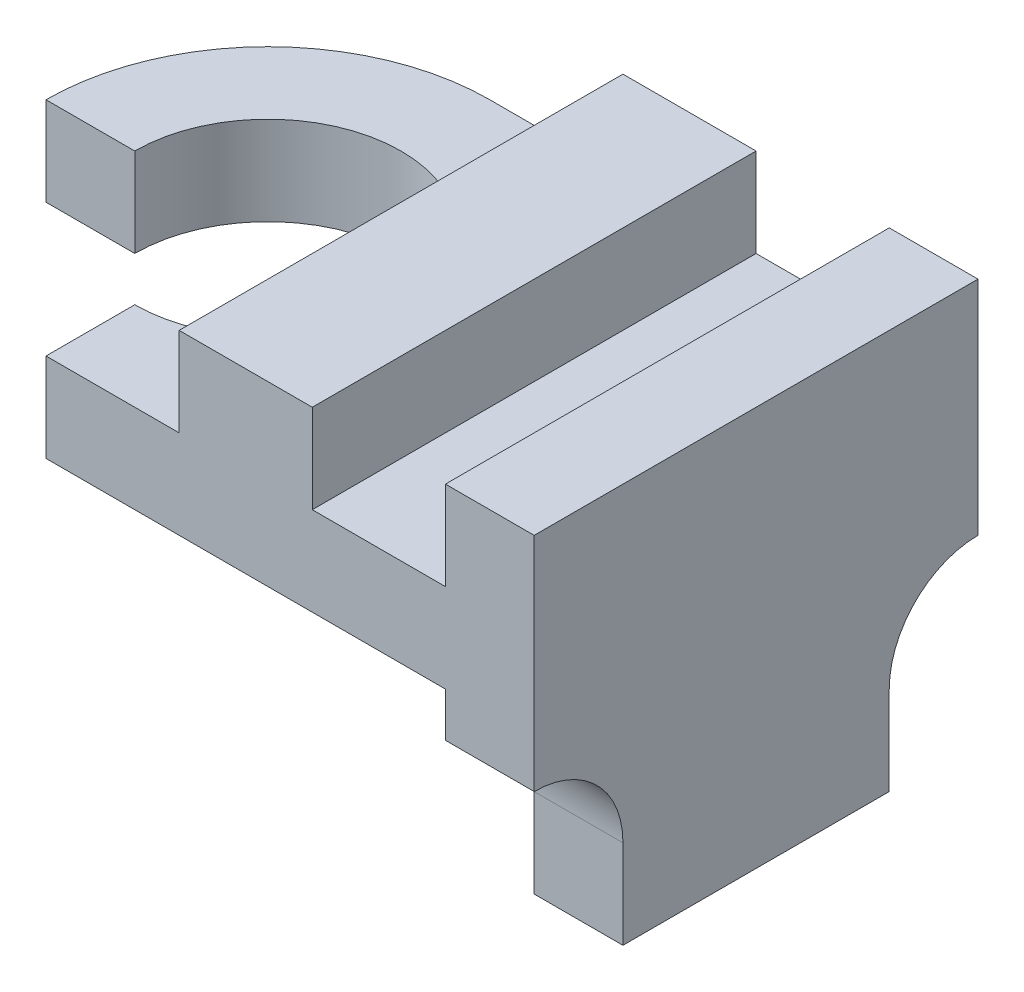
ISO-10303-21;
HEADER;
FILE_DESCRIPTION(('STEP AP214'),'2;1');
FILE_NAME('part.step','',(''),(''),'','','');
FILE_SCHEMA(('AUTOMOTIVE_DESIGN { 1 0 10303 214 1 1 1 1 }'));
ENDSEC;
DATA;
#1=APPLICATION_CONTEXT('core data for automotive mechanical design processes');
#2=APPLICATION_PROTOCOL_DEFINITION('international standard','automotive_design',2000,#1);
#3=PRODUCT_CONTEXT('',#1,'mechanical');
#4=PRODUCT('Part','Part','',(#3));
#5=PRODUCT_RELATED_PRODUCT_CATEGORY('part','',(#4));
#6=PRODUCT_DEFINITION_FORMATION('','',#4);
#7=PRODUCT_DEFINITION_CONTEXT('part definition',#1,'design');
#8=PRODUCT_DEFINITION('design','',#6,#7);
#9=PRODUCT_DEFINITION_SHAPE('','',#8);
#10=(LENGTH_UNIT() NAMED_UNIT(*) SI_UNIT(.MILLI.,.METRE.));
#11=(NAMED_UNIT(*) PLANE_ANGLE_UNIT() SI_UNIT($,.RADIAN.));
#12=(NAMED_UNIT(*) SI_UNIT($,.STERADIAN.) SOLID_ANGLE_UNIT());
#13=UNCERTAINTY_MEASURE_WITH_UNIT(LENGTH_MEASURE(1.E-05),#10,'distance_accuracy_value','');
#14=(GEOMETRIC_REPRESENTATION_CONTEXT(3) GLOBAL_UNCERTAINTY_ASSIGNED_CONTEXT((#13)) GLOBAL_UNIT_ASSIGNED_CONTEXT((#10,
#11,#12)) REPRESENTATION_CONTEXT('',''));
#15=CARTESIAN_POINT('',(0.,0.,0.));
#16=DIRECTION('',(0.,0.,1.));
#17=DIRECTION('',(1.,0.,0.));
#18=AXIS2_PLACEMENT_3D('',#15,#16,#17);
#19=CARTESIAN_POINT('',(0.,0.,0.));
#20=DIRECTION('',(0.,0.,-1.));
#21=DIRECTION('',(-1.,0.,0.));
#22=AXIS2_PLACEMENT_3D('',#19,#20,#21);
#23=PLANE('',#22);
#24=DIRECTION('',(1.,0.,0.));
#25=VECTOR('',#24,1.);
#26=CARTESIAN_POINT('',(0.,0.,0.));
#27=LINE('',#26,#25);
#28=CARTESIAN_POINT('',(0.,0.,0.));
#29=VERTEX_POINT('',#28);
#30=CARTESIAN_POINT('',(90.,0.,0.));
#31=VERTEX_POINT('',#30);
#32=EDGE_CURVE('E37',#29,#31,#27,.T.);
#33=ORIENTED_EDGE('',*,*,#32,.F.);
#34=DIRECTION('',(0.,-1.,0.));
#35=VECTOR('',#34,1.);
#36=CARTESIAN_POINT('',(0.,20.,0.));
#37=LINE('',#36,#35);
#38=CARTESIAN_POINT('',(0.,20.,0.));
#39=VERTEX_POINT('',#38);
#40=EDGE_CURVE('E207',#39,#29,#37,.T.);
#41=ORIENTED_EDGE('',*,*,#40,.F.);
#42=DIRECTION('',(1.,0.,0.));
#43=VECTOR('',#42,1.);
#44=CARTESIAN_POINT('',(0.,20.,0.));
#45=LINE('',#44,#43);
#46=CARTESIAN_POINT('',(30.,20.,0.));
#47=VERTEX_POINT('',#46);
#48=EDGE_CURVE('E206',#39,#47,#45,.T.);
#49=ORIENTED_EDGE('',*,*,#48,.T.);
#50=DIRECTION('',(0.,1.,0.));
#51=VECTOR('',#50,1.);
#52=CARTESIAN_POINT('',(30.,40.,0.));
#53=LINE('',#52,#51);
#54=CARTESIAN_POINT('',(30.,40.,0.));
#55=VERTEX_POINT('',#54);
#56=EDGE_CURVE('E277',#47,#55,#53,.T.);
#57=ORIENTED_EDGE('',*,*,#56,.T.);
#58=DIRECTION('',(-1.,0.,0.));
#59=VECTOR('',#58,1.);
#60=CARTESIAN_POINT('',(0.,40.,0.));
#61=LINE('',#60,#59);
#62=CARTESIAN_POINT('',(60.,40.,0.));
#63=VERTEX_POINT('',#62);
#64=EDGE_CURVE('E253',#63,#55,#61,.T.);
#65=ORIENTED_EDGE('',*,*,#64,.F.);
#66=DIRECTION('',(0.,-1.,0.));
#67=VECTOR('',#66,1.);
#68=CARTESIAN_POINT('',(60.,40.,0.));
#69=LINE('',#68,#67);
#70=CARTESIAN_POINT('',(60.,20.,0.));
#71=VERTEX_POINT('',#70);
#72=EDGE_CURVE('E275',#63,#71,#69,.T.);
#73=ORIENTED_EDGE('',*,*,#72,.T.);
#74=DIRECTION('',(1.,0.,0.));
#75=VECTOR('',#74,1.);
#76=CARTESIAN_POINT('',(90.,20.,0.));
#77=LINE('',#76,#75);
#78=CARTESIAN_POINT('',(90.,20.,0.));
#79=VERTEX_POINT('',#78);
#80=EDGE_CURVE('E300',#71,#79,#77,.T.);
#81=ORIENTED_EDGE('',*,*,#80,.T.);
#82=DIRECTION('',(0.,1.,0.));
#83=VECTOR('',#82,1.);
#84=CARTESIAN_POINT('',(90.,40.,0.));
#85=LINE('',#84,#83);
#86=CARTESIAN_POINT('',(90.,40.,0.));
#87=VERTEX_POINT('',#86);
#88=EDGE_CURVE('E295',#79,#87,#85,.T.);
#89=ORIENTED_EDGE('',*,*,#88,.T.);
#90=CARTESIAN_POINT('',(110.,40.,0.));
#91=VERTEX_POINT('',#90);
#92=EDGE_CURVE('E254',#91,#87,#61,.T.);
#93=ORIENTED_EDGE('',*,*,#92,.F.);
#94=DIRECTION('',(0.,1.,0.));
#95=VECTOR('',#94,1.);
#96=CARTESIAN_POINT('',(110.,0.,0.));
#97=LINE('',#96,#95);
#98=CARTESIAN_POINT('',(110.,-10.,0.));
#99=VERTEX_POINT('',#98);
#100=EDGE_CURVE('E252',#99,#91,#97,.T.);
#101=ORIENTED_EDGE('',*,*,#100,.F.);
#102=DIRECTION('',(-1.,0.,0.));
#103=VECTOR('',#102,1.);
#104=CARTESIAN_POINT('',(140.,-10.,0.));
#105=LINE('',#104,#103);
#106=CARTESIAN_POINT('',(90.,-10.,0.));
#107=VERTEX_POINT('',#106);
#108=EDGE_CURVE('E408',#99,#107,#105,.T.);
#109=ORIENTED_EDGE('',*,*,#108,.T.);
#110=DIRECTION('',(0.,1.,0.));
#111=VECTOR('',#110,1.);
#112=CARTESIAN_POINT('',(90.,-50.,0.));
#113=LINE('',#112,#111);
#114=EDGE_CURVE('E433',#107,#31,#113,.T.);
#115=ORIENTED_EDGE('',*,*,#114,.T.);
#116=EDGE_LOOP('',(#33,#41,#49,#57,#65,#73,#81,#89,#93,#101,#109,#115));
#117=FACE_BOUND('',#116,.T.);
#118=ADVANCED_FACE('F33',(#117),#23,.T.);
#119=CARTESIAN_POINT('',(0.,20.,0.));
#120=DIRECTION('',(0.,-1.,0.));
#121=DIRECTION('',(0.,0.,-1.));
#122=AXIS2_PLACEMENT_3D('',#119,#120,#121);
#123=PLANE('',#122);
#124=DIRECTION('',(0.,0.,1.));
#125=VECTOR('',#124,1.);
#126=CARTESIAN_POINT('',(30.,20.,0.));
#127=LINE('',#126,#125);
#128=CARTESIAN_POINT('',(30.,20.,50.));
#129=VERTEX_POINT('',#128);
#130=CARTESIAN_POINT('',(30.,20.,100.));
#131=VERTEX_POINT('',#130);
#132=EDGE_CURVE('E281',#129,#131,#127,.T.);
#133=ORIENTED_EDGE('',*,*,#132,.F.);
#134=CARTESIAN_POINT('',(0.,20.,50.));
#135=DIRECTION('',(0.,-1.,0.));
#136=DIRECTION('',(0.,0.,1.));
#137=AXIS2_PLACEMENT_3D('',#134,#135,#136);
#138=CIRCLE('',#137,30.);
#139=CARTESIAN_POINT('',(0.,20.,80.));
#140=VERTEX_POINT('',#139);
#141=EDGE_CURVE('E378',#129,#140,#138,.T.);
#142=ORIENTED_EDGE('',*,*,#141,.T.);
#143=DIRECTION('',(0.,0.,1.));
#144=VECTOR('',#143,1.);
#145=CARTESIAN_POINT('',(0.,20.,0.));
#146=LINE('',#145,#144);
#147=CARTESIAN_POINT('',(0.,20.,100.));
#148=VERTEX_POINT('',#147);
#149=EDGE_CURVE('E217',#140,#148,#146,.T.);
#150=ORIENTED_EDGE('',*,*,#149,.T.);
#151=DIRECTION('',(1.,0.,0.));
#152=VECTOR('',#151,1.);
#153=CARTESIAN_POINT('',(0.,20.,100.));
#154=LINE('',#153,#152);
#155=EDGE_CURVE('E285',#148,#131,#154,.T.);
#156=ORIENTED_EDGE('',*,*,#155,.T.);
#157=EDGE_LOOP('',(#133,#142,#150,#156));
#158=FACE_BOUND('',#157,.T.);
#159=ADVANCED_FACE('F352',(#158),#123,.F.);
#160=CARTESIAN_POINT('',(0.,0.,100.));
#161=DIRECTION('',(0.,1.,0.));
#162=DIRECTION('',(0.,0.,1.));
#163=AXIS2_PLACEMENT_3D('',#160,#161,#162);
#164=PLANE('',#163);
#165=DIRECTION('',(-1.,0.,0.));
#166=VECTOR('',#165,1.);
#167=CARTESIAN_POINT('',(0.,0.,50.));
#168=LINE('',#167,#166);
#169=CARTESIAN_POINT('',(-30.,0.,50.));
#170=VERTEX_POINT('',#169);
#171=CARTESIAN_POINT('',(-50.,0.,50.));
#172=VERTEX_POINT('',#171);
#173=EDGE_CURVE('E211',#170,#172,#168,.T.);
#174=ORIENTED_EDGE('',*,*,#173,.T.);
#175=CARTESIAN_POINT('',(0.,0.,50.));
#176=DIRECTION('',(0.,1.,0.));
#177=DIRECTION('',(0.,0.,-1.));
#178=AXIS2_PLACEMENT_3D('',#175,#176,#177);
#179=CIRCLE('',#178,50.);
#180=EDGE_CURVE('E193',#29,#172,#179,.T.);
#181=ORIENTED_EDGE('',*,*,#180,.F.);
#182=ORIENTED_EDGE('',*,*,#32,.T.);
#183=DIRECTION('',(0.,0.,-1.));
#184=VECTOR('',#183,1.);
#185=CARTESIAN_POINT('',(90.,0.,100.));
#186=LINE('',#185,#184);
#187=CARTESIAN_POINT('',(90.,0.,40.));
#188=VERTEX_POINT('',#187);
#189=EDGE_CURVE('E227',#188,#31,#186,.T.);
#190=ORIENTED_EDGE('',*,*,#189,.F.);
#191=DIRECTION('',(1.,0.,0.));
#192=VECTOR('',#191,1.);
#193=CARTESIAN_POINT('',(90.,0.,40.));
#194=LINE('',#193,#192);
#195=CARTESIAN_POINT('',(50.,0.,40.));
#196=VERTEX_POINT('',#195);
#197=EDGE_CURVE('E392',#196,#188,#194,.T.);
#198=ORIENTED_EDGE('',*,*,#197,.F.);
#199=DIRECTION('',(0.,0.,-1.));
#200=VECTOR('',#199,1.);
#201=CARTESIAN_POINT('',(50.,0.,60.));
#202=LINE('',#201,#200);
#203=CARTESIAN_POINT('',(50.,0.,60.));
#204=VERTEX_POINT('',#203);
#205=EDGE_CURVE('E395',#204,#196,#202,.T.);
#206=ORIENTED_EDGE('',*,*,#205,.F.);
#207=DIRECTION('',(-1.,0.,0.));
#208=VECTOR('',#207,1.);
#209=CARTESIAN_POINT('',(90.,0.,60.));
#210=LINE('',#209,#208);
#211=CARTESIAN_POINT('',(90.,0.,60.));
#212=VERTEX_POINT('',#211);
#213=EDGE_CURVE('E388',#212,#204,#210,.T.);
#214=ORIENTED_EDGE('',*,*,#213,.F.);
#215=CARTESIAN_POINT('',(90.,0.,100.));
#216=VERTEX_POINT('',#215);
#217=EDGE_CURVE('E240',#216,#212,#186,.T.);
#218=ORIENTED_EDGE('',*,*,#217,.F.);
#219=DIRECTION('',(1.,0.,0.));
#220=VECTOR('',#219,1.);
#221=CARTESIAN_POINT('',(0.,0.,100.));
#222=LINE('',#221,#220);
#223=CARTESIAN_POINT('',(0.,0.,100.));
#224=VERTEX_POINT('',#223);
#225=EDGE_CURVE('E234',#224,#216,#222,.T.);
#226=ORIENTED_EDGE('',*,*,#225,.F.);
#227=DIRECTION('',(0.,0.,-1.));
#228=VECTOR('',#227,1.);
#229=CARTESIAN_POINT('',(0.,0.,100.));
#230=LINE('',#229,#228);
#231=CARTESIAN_POINT('',(0.,0.,80.));
#232=VERTEX_POINT('',#231);
#233=EDGE_CURVE('E222',#224,#232,#230,.T.);
#234=ORIENTED_EDGE('',*,*,#233,.T.);
#235=CARTESIAN_POINT('',(0.,0.,50.));
#236=DIRECTION('',(0.,-1.,0.));
#237=DIRECTION('',(0.,0.,1.));
#238=AXIS2_PLACEMENT_3D('',#235,#236,#237);
#239=CIRCLE('',#238,30.);
#240=EDGE_CURVE('E374',#170,#232,#239,.T.);
#241=ORIENTED_EDGE('',*,*,#240,.F.);
#242=EDGE_LOOP('',(#174,#181,#182,#190,#198,#206,#214,#218,#226,#234,#241));
#243=FACE_BOUND('',#242,.T.);
#244=ADVANCED_FACE('F357',(#243),#164,.F.);
#245=CARTESIAN_POINT('',(90.,-50.,100.));
#246=DIRECTION('',(1.,0.,0.));
#247=DIRECTION('',(0.,0.,-1.));
#248=AXIS2_PLACEMENT_3D('',#245,#246,#247);
#249=PLANE('',#248);
#250=DIRECTION('',(0.,0.,1.));
#251=VECTOR('',#250,1.);
#252=CARTESIAN_POINT('',(90.,-30.,60.));
#253=LINE('',#252,#251);
#254=CARTESIAN_POINT('',(90.,-30.,40.));
#255=VERTEX_POINT('',#254);
#256=CARTESIAN_POINT('',(90.,-30.,60.));
#257=VERTEX_POINT('',#256);
#258=EDGE_CURVE('E389',#255,#257,#253,.T.);
#259=ORIENTED_EDGE('',*,*,#258,.F.);
#260=DIRECTION('',(0.,1.,0.));
#261=VECTOR('',#260,1.);
#262=CARTESIAN_POINT('',(90.,-30.,40.));
#263=LINE('',#262,#261);
#264=EDGE_CURVE('E391',#255,#188,#263,.T.);
#265=ORIENTED_EDGE('',*,*,#264,.T.);
#266=ORIENTED_EDGE('',*,*,#189,.T.);
#267=ORIENTED_EDGE('',*,*,#114,.F.);
#268=CARTESIAN_POINT('',(90.,-30.,0.));
#269=DIRECTION('',(-1.,0.,0.));
#270=DIRECTION('',(0.,0.,-1.));
#271=AXIS2_PLACEMENT_3D('',#268,#269,#270);
#272=CIRCLE('',#271,20.);
#273=CARTESIAN_POINT('',(90.,-30.,20.));
#274=VERTEX_POINT('',#273);
#275=EDGE_CURVE('E403',#274,#107,#272,.T.);
#276=ORIENTED_EDGE('',*,*,#275,.F.);
#277=DIRECTION('',(0.,1.,0.));
#278=VECTOR('',#277,1.);
#279=CARTESIAN_POINT('',(90.,-30.,20.));
#280=LINE('',#279,#278);
#281=CARTESIAN_POINT('',(90.,-50.,20.));
#282=VERTEX_POINT('',#281);
#283=EDGE_CURVE('E405',#282,#274,#280,.T.);
#284=ORIENTED_EDGE('',*,*,#283,.F.);
#285=DIRECTION('',(0.,0.,-1.));
#286=VECTOR('',#285,1.);
#287=CARTESIAN_POINT('',(90.,-50.,100.));
#288=LINE('',#287,#286);
#289=CARTESIAN_POINT('',(90.,-50.,80.));
#290=VERTEX_POINT('',#289);
#291=EDGE_CURVE('E431',#290,#282,#288,.T.);
#292=ORIENTED_EDGE('',*,*,#291,.F.);
#293=DIRECTION('',(0.,-1.,0.));
#294=VECTOR('',#293,1.);
#295=CARTESIAN_POINT('',(90.,-30.,80.));
#296=LINE('',#295,#294);
#297=CARTESIAN_POINT('',(90.,-30.,80.));
#298=VERTEX_POINT('',#297);
#299=EDGE_CURVE('E419',#298,#290,#296,.T.);
#300=ORIENTED_EDGE('',*,*,#299,.F.);
#301=CARTESIAN_POINT('',(90.,-30.,100.));
#302=DIRECTION('',(-1.,0.,0.));
#303=DIRECTION('',(0.,0.,1.));
#304=AXIS2_PLACEMENT_3D('',#301,#302,#303);
#305=CIRCLE('',#304,20.);
#306=CARTESIAN_POINT('',(90.,-10.,100.));
#307=VERTEX_POINT('',#306);
#308=EDGE_CURVE('E416',#307,#298,#305,.T.);
#309=ORIENTED_EDGE('',*,*,#308,.F.);
#310=DIRECTION('',(0.,1.,0.));
#311=VECTOR('',#310,1.);
#312=CARTESIAN_POINT('',(90.,-50.,100.));
#313=LINE('',#312,#311);
#314=EDGE_CURVE('E288',#307,#216,#313,.T.);
#315=ORIENTED_EDGE('',*,*,#314,.T.);
#316=ORIENTED_EDGE('',*,*,#217,.T.);
#317=DIRECTION('',(0.,1.,0.));
#318=VECTOR('',#317,1.);
#319=CARTESIAN_POINT('',(90.,-30.,60.));
#320=LINE('',#319,#318);
#321=EDGE_CURVE('E400',#257,#212,#320,.T.);
#322=ORIENTED_EDGE('',*,*,#321,.F.);
#323=EDGE_LOOP('',(#259,#265,#266,#267,#276,#284,#292,#300,#309,#315,#316,#322));
#324=FACE_BOUND('',#323,.T.);
#325=ADVANCED_FACE('F366',(#324),#249,.F.);
#326=CARTESIAN_POINT('',(0.,40.,100.));
#327=DIRECTION('',(0.,-1.,0.));
#328=DIRECTION('',(0.,0.,-1.));
#329=AXIS2_PLACEMENT_3D('',#326,#327,#328);
#330=PLANE('',#329);
#331=ORIENTED_EDGE('',*,*,#92,.T.);
#332=DIRECTION('',(0.,0.,1.));
#333=VECTOR('',#332,1.);
#334=CARTESIAN_POINT('',(90.,40.,0.));
#335=LINE('',#334,#333);
#336=CARTESIAN_POINT('',(90.,40.,100.));
#337=VERTEX_POINT('',#336);
#338=EDGE_CURVE('E302',#87,#337,#335,.T.);
#339=ORIENTED_EDGE('',*,*,#338,.T.);
#340=DIRECTION('',(-1.,0.,0.));
#341=VECTOR('',#340,1.);
#342=CARTESIAN_POINT('',(0.,40.,100.));
#343=LINE('',#342,#341);
#344=CARTESIAN_POINT('',(110.,40.,100.));
#345=VERTEX_POINT('',#344);
#346=EDGE_CURVE('E248',#345,#337,#343,.T.);
#347=ORIENTED_EDGE('',*,*,#346,.F.);
#348=DIRECTION('',(0.,0.,-1.));
#349=VECTOR('',#348,1.);
#350=CARTESIAN_POINT('',(110.,40.,100.));
#351=LINE('',#350,#349);
#352=EDGE_CURVE('E226',#345,#91,#351,.T.);
#353=ORIENTED_EDGE('',*,*,#352,.T.);
#354=EDGE_LOOP('',(#331,#339,#347,#353));
#355=FACE_BOUND('',#354,.T.);
#356=ADVANCED_FACE('F314',(#355),#330,.F.);
#357=CARTESIAN_POINT('',(0.,0.,100.));
#358=DIRECTION('',(1.,0.,0.));
#359=DIRECTION('',(0.,0.,-1.));
#360=AXIS2_PLACEMENT_3D('',#357,#358,#359);
#361=PLANE('',#360);
#362=ORIENTED_EDGE('',*,*,#149,.F.);
#363=DIRECTION('',(0.,-1.,0.));
#364=VECTOR('',#363,1.);
#365=CARTESIAN_POINT('',(0.,20.,80.));
#366=LINE('',#365,#364);
#367=EDGE_CURVE('E213',#140,#232,#366,.T.);
#368=ORIENTED_EDGE('',*,*,#367,.T.);
#369=ORIENTED_EDGE('',*,*,#233,.F.);
#370=DIRECTION('',(0.,-1.,0.));
#371=VECTOR('',#370,1.);
#372=CARTESIAN_POINT('',(0.,0.,100.));
#373=LINE('',#372,#371);
#374=EDGE_CURVE('E239',#148,#224,#373,.T.);
#375=ORIENTED_EDGE('',*,*,#374,.F.);
#376=EDGE_LOOP('',(#362,#368,#369,#375));
#377=FACE_BOUND('',#376,.T.);
#378=ADVANCED_FACE('F35',(#377),#361,.F.);
#379=CARTESIAN_POINT('',(110.,0.,100.));
#380=DIRECTION('',(-1.,0.,0.));
#381=DIRECTION('',(0.,0.,1.));
#382=AXIS2_PLACEMENT_3D('',#379,#380,#381);
#383=PLANE('',#382);
#384=DIRECTION('',(0.,1.,0.));
#385=VECTOR('',#384,1.);
#386=CARTESIAN_POINT('',(110.,0.,20.));
#387=LINE('',#386,#385);
#388=CARTESIAN_POINT('',(110.,-50.,20.));
#389=VERTEX_POINT('',#388);
#390=CARTESIAN_POINT('',(110.,-30.,20.));
#391=VERTEX_POINT('',#390);
#392=EDGE_CURVE('E411',#389,#391,#387,.T.);
#393=ORIENTED_EDGE('',*,*,#392,.T.);
#394=CARTESIAN_POINT('',(110.,-30.,0.));
#395=DIRECTION('',(-1.,0.,0.));
#396=DIRECTION('',(0.,0.,1.));
#397=AXIS2_PLACEMENT_3D('',#394,#395,#396);
#398=CIRCLE('',#397,20.);
#399=EDGE_CURVE('E414',#391,#99,#398,.T.);
#400=ORIENTED_EDGE('',*,*,#399,.T.);
#401=ORIENTED_EDGE('',*,*,#100,.T.);
#402=ORIENTED_EDGE('',*,*,#352,.F.);
#403=DIRECTION('',(0.,1.,0.));
#404=VECTOR('',#403,1.);
#405=CARTESIAN_POINT('',(110.,0.,100.));
#406=LINE('',#405,#404);
#407=CARTESIAN_POINT('',(110.,-10.,100.));
#408=VERTEX_POINT('',#407);
#409=EDGE_CURVE('E238',#408,#345,#406,.T.);
#410=ORIENTED_EDGE('',*,*,#409,.F.);
#411=CARTESIAN_POINT('',(110.,-30.,100.));
#412=DIRECTION('',(-1.,0.,0.));
#413=DIRECTION('',(0.,0.,1.));
#414=AXIS2_PLACEMENT_3D('',#411,#412,#413);
#415=CIRCLE('',#414,20.);
#416=CARTESIAN_POINT('',(110.,-30.,80.));
#417=VERTEX_POINT('',#416);
#418=EDGE_CURVE('E427',#408,#417,#415,.T.);
#419=ORIENTED_EDGE('',*,*,#418,.T.);
#420=DIRECTION('',(0.,-1.,0.));
#421=VECTOR('',#420,1.);
#422=CARTESIAN_POINT('',(110.,0.,80.));
#423=LINE('',#422,#421);
#424=CARTESIAN_POINT('',(110.,-50.,80.));
#425=VERTEX_POINT('',#424);
#426=EDGE_CURVE('E423',#417,#425,#423,.T.);
#427=ORIENTED_EDGE('',*,*,#426,.T.);
#428=DIRECTION('',(0.,0.,1.));
#429=VECTOR('',#428,1.);
#430=CARTESIAN_POINT('',(110.,-50.,100.));
#431=LINE('',#430,#429);
#432=EDGE_CURVE('E429',#389,#425,#431,.T.);
#433=ORIENTED_EDGE('',*,*,#432,.F.);
#434=EDGE_LOOP('',(#393,#400,#401,#402,#410,#419,#427,#433));
#435=FACE_BOUND('',#434,.T.);
#436=ADVANCED_FACE('F329',(#435),#383,.F.);
#437=ORIENTED_EDGE('',*,*,#64,.T.);
#438=DIRECTION('',(0.,0.,1.));
#439=VECTOR('',#438,1.);
#440=CARTESIAN_POINT('',(30.,40.,0.));
#441=LINE('',#440,#439);
#442=CARTESIAN_POINT('',(30.,40.,100.));
#443=VERTEX_POINT('',#442);
#444=EDGE_CURVE('E267',#55,#443,#441,.T.);
#445=ORIENTED_EDGE('',*,*,#444,.T.);
#446=CARTESIAN_POINT('',(60.,40.,100.));
#447=VERTEX_POINT('',#446);
#448=EDGE_CURVE('E247',#447,#443,#343,.T.);
#449=ORIENTED_EDGE('',*,*,#448,.F.);
#450=DIRECTION('',(0.,0.,1.));
#451=VECTOR('',#450,1.);
#452=CARTESIAN_POINT('',(60.,40.,0.));
#453=LINE('',#452,#451);
#454=EDGE_CURVE('E269',#63,#447,#453,.T.);
#455=ORIENTED_EDGE('',*,*,#454,.F.);
#456=EDGE_LOOP('',(#437,#445,#449,#455));
#457=FACE_BOUND('',#456,.T.);
#458=ADVANCED_FACE('F265',(#457),#330,.F.);
#459=CARTESIAN_POINT('',(0.,0.,100.));
#460=DIRECTION('',(0.,0.,-1.));
#461=DIRECTION('',(-1.,0.,0.));
#462=AXIS2_PLACEMENT_3D('',#459,#460,#461);
#463=PLANE('',#462);
#464=ORIENTED_EDGE('',*,*,#314,.F.);
#465=DIRECTION('',(-1.,0.,0.));
#466=VECTOR('',#465,1.);
#467=CARTESIAN_POINT('',(140.,-10.,100.));
#468=LINE('',#467,#466);
#469=EDGE_CURVE('E325',#408,#307,#468,.T.);
#470=ORIENTED_EDGE('',*,*,#469,.F.);
#471=ORIENTED_EDGE('',*,*,#409,.T.);
#472=ORIENTED_EDGE('',*,*,#346,.T.);
#473=DIRECTION('',(0.,1.,0.));
#474=VECTOR('',#473,1.);
#475=CARTESIAN_POINT('',(90.,40.,100.));
#476=LINE('',#475,#474);
#477=CARTESIAN_POINT('',(90.,20.,100.));
#478=VERTEX_POINT('',#477);
#479=EDGE_CURVE('E291',#478,#337,#476,.T.);
#480=ORIENTED_EDGE('',*,*,#479,.F.);
#481=DIRECTION('',(1.,0.,0.));
#482=VECTOR('',#481,1.);
#483=CARTESIAN_POINT('',(90.,20.,100.));
#484=LINE('',#483,#482);
#485=CARTESIAN_POINT('',(60.,20.,100.));
#486=VERTEX_POINT('',#485);
#487=EDGE_CURVE('E298',#486,#478,#484,.T.);
#488=ORIENTED_EDGE('',*,*,#487,.F.);
#489=DIRECTION('',(0.,-1.,0.));
#490=VECTOR('',#489,1.);
#491=CARTESIAN_POINT('',(60.,40.,100.));
#492=LINE('',#491,#490);
#493=EDGE_CURVE('E304',#447,#486,#492,.T.);
#494=ORIENTED_EDGE('',*,*,#493,.F.);
#495=ORIENTED_EDGE('',*,*,#448,.T.);
#496=DIRECTION('',(0.,1.,0.));
#497=VECTOR('',#496,1.);
#498=CARTESIAN_POINT('',(30.,40.,100.));
#499=LINE('',#498,#497);
#500=EDGE_CURVE('E282',#131,#443,#499,.T.);
#501=ORIENTED_EDGE('',*,*,#500,.F.);
#502=ORIENTED_EDGE('',*,*,#155,.F.);
#503=ORIENTED_EDGE('',*,*,#374,.T.);
#504=ORIENTED_EDGE('',*,*,#225,.T.);
#505=EDGE_LOOP('',(#464,#470,#471,#472,#480,#488,#494,#495,#501,#502,#503,#504));
#506=FACE_BOUND('',#505,.T.);
#507=ADVANCED_FACE('F320',(#506),#463,.F.);
#508=CARTESIAN_POINT('',(90.,40.,0.));
#509=DIRECTION('',(1.,0.,0.));
#510=DIRECTION('',(0.,0.,-1.));
#511=AXIS2_PLACEMENT_3D('',#508,#509,#510);
#512=PLANE('',#511);
#513=ORIENTED_EDGE('',*,*,#479,.T.);
#514=ORIENTED_EDGE('',*,*,#338,.F.);
#515=ORIENTED_EDGE('',*,*,#88,.F.);
#516=DIRECTION('',(0.,0.,1.));
#517=VECTOR('',#516,1.);
#518=CARTESIAN_POINT('',(90.,20.,0.));
#519=LINE('',#518,#517);
#520=EDGE_CURVE('E309',#79,#478,#519,.T.);
#521=ORIENTED_EDGE('',*,*,#520,.T.);
#522=EDGE_LOOP('',(#513,#514,#515,#521));
#523=FACE_BOUND('',#522,.T.);
#524=ADVANCED_FACE('F333',(#523),#512,.F.);
#525=CARTESIAN_POINT('',(90.,20.,0.));
#526=DIRECTION('',(0.,-1.,0.));
#527=DIRECTION('',(1.,0.,0.));
#528=AXIS2_PLACEMENT_3D('',#525,#526,#527);
#529=PLANE('',#528);
#530=ORIENTED_EDGE('',*,*,#487,.T.);
#531=ORIENTED_EDGE('',*,*,#520,.F.);
#532=ORIENTED_EDGE('',*,*,#80,.F.);
#533=DIRECTION('',(0.,0.,1.));
#534=VECTOR('',#533,1.);
#535=CARTESIAN_POINT('',(60.,20.,0.));
#536=LINE('',#535,#534);
#537=EDGE_CURVE('E311',#71,#486,#536,.T.);
#538=ORIENTED_EDGE('',*,*,#537,.T.);
#539=EDGE_LOOP('',(#530,#531,#532,#538));
#540=FACE_BOUND('',#539,.T.);
#541=ADVANCED_FACE('F335',(#540),#529,.F.);
#542=CARTESIAN_POINT('',(60.,40.,0.));
#543=DIRECTION('',(-1.,0.,0.));
#544=DIRECTION('',(0.,0.,1.));
#545=AXIS2_PLACEMENT_3D('',#542,#543,#544);
#546=PLANE('',#545);
#547=ORIENTED_EDGE('',*,*,#493,.T.);
#548=ORIENTED_EDGE('',*,*,#537,.F.);
#549=ORIENTED_EDGE('',*,*,#72,.F.);
#550=ORIENTED_EDGE('',*,*,#454,.T.);
#551=EDGE_LOOP('',(#547,#548,#549,#550));
#552=FACE_BOUND('',#551,.T.);
#553=ADVANCED_FACE('F340',(#552),#546,.F.);
#554=CARTESIAN_POINT('',(30.,40.,0.));
#555=DIRECTION('',(1.,0.,0.));
#556=DIRECTION('',(0.,1.,0.));
#557=AXIS2_PLACEMENT_3D('',#554,#555,#556);
#558=PLANE('',#557);
#559=ORIENTED_EDGE('',*,*,#500,.T.);
#560=ORIENTED_EDGE('',*,*,#444,.F.);
#561=ORIENTED_EDGE('',*,*,#56,.F.);
#562=EDGE_CURVE('E292',#47,#129,#127,.T.);
#563=ORIENTED_EDGE('',*,*,#562,.T.);
#564=ORIENTED_EDGE('',*,*,#132,.T.);
#565=EDGE_LOOP('',(#559,#560,#561,#563,#564));
#566=FACE_BOUND('',#565,.T.);
#567=ADVANCED_FACE('F342',(#566),#558,.F.);
#568=ORIENTED_EDGE('',*,*,#48,.F.);
#569=CARTESIAN_POINT('',(0.,20.,50.));
#570=DIRECTION('',(0.,1.,0.));
#571=DIRECTION('',(0.,0.,-1.));
#572=AXIS2_PLACEMENT_3D('',#569,#570,#571);
#573=CIRCLE('',#572,50.);
#574=CARTESIAN_POINT('',(-50.,20.,50.));
#575=VERTEX_POINT('',#574);
#576=EDGE_CURVE('E190',#39,#575,#573,.T.);
#577=ORIENTED_EDGE('',*,*,#576,.T.);
#578=DIRECTION('',(-1.,0.,0.));
#579=VECTOR('',#578,1.);
#580=CARTESIAN_POINT('',(0.,20.,50.));
#581=LINE('',#580,#579);
#582=CARTESIAN_POINT('',(-30.,20.,50.));
#583=VERTEX_POINT('',#582);
#584=EDGE_CURVE('E199',#583,#575,#581,.T.);
#585=ORIENTED_EDGE('',*,*,#584,.F.);
#586=EDGE_CURVE('E51',#583,#129,#138,.T.);
#587=ORIENTED_EDGE('',*,*,#586,.T.);
#588=ORIENTED_EDGE('',*,*,#562,.F.);
#589=EDGE_LOOP('',(#568,#577,#585,#587,#588));
#590=FACE_BOUND('',#589,.T.);
#591=ADVANCED_FACE('F204',(#590),#123,.F.);
#592=CARTESIAN_POINT('',(0.,-50.,0.));
#593=DIRECTION('',(0.,1.,0.));
#594=DIRECTION('',(0.,0.,1.));
#595=AXIS2_PLACEMENT_3D('',#592,#593,#594);
#596=PLANE('',#595);
#597=ORIENTED_EDGE('',*,*,#291,.T.);
#598=DIRECTION('',(1.,0.,0.));
#599=VECTOR('',#598,1.);
#600=CARTESIAN_POINT('',(0.,-50.,20.));
#601=LINE('',#600,#599);
#602=EDGE_CURVE('E11',#282,#389,#601,.T.);
#603=ORIENTED_EDGE('',*,*,#602,.T.);
#604=ORIENTED_EDGE('',*,*,#432,.T.);
#605=DIRECTION('',(-1.,0.,0.));
#606=VECTOR('',#605,1.);
#607=CARTESIAN_POINT('',(0.,-50.,80.));
#608=LINE('',#607,#606);
#609=EDGE_CURVE('E43',#425,#290,#608,.T.);
#610=ORIENTED_EDGE('',*,*,#609,.T.);
#611=EDGE_LOOP('',(#597,#603,#604,#610));
#612=FACE_BOUND('',#611,.T.);
#613=ADVANCED_FACE('F447',(#612),#596,.F.);
#614=CARTESIAN_POINT('',(140.,-30.,100.));
#615=DIRECTION('',(-1.,0.,0.));
#616=DIRECTION('',(0.,0.,1.));
#617=AXIS2_PLACEMENT_3D('',#614,#615,#616);
#618=CYLINDRICAL_SURFACE('',#617,20.);
#619=ORIENTED_EDGE('',*,*,#469,.T.);
#620=ORIENTED_EDGE('',*,*,#308,.T.);
#621=DIRECTION('',(-1.,0.,0.));
#622=VECTOR('',#621,1.);
#623=CARTESIAN_POINT('',(140.,-30.,80.));
#624=LINE('',#623,#622);
#625=EDGE_CURVE('E421',#417,#298,#624,.T.);
#626=ORIENTED_EDGE('',*,*,#625,.F.);
#627=ORIENTED_EDGE('',*,*,#418,.F.);
#628=EDGE_LOOP('',(#619,#620,#626,#627));
#629=FACE_BOUND('',#628,.T.);
#630=ADVANCED_FACE('F460',(#629),#618,.F.);
#631=CARTESIAN_POINT('',(140.,-30.,80.));
#632=DIRECTION('',(0.,0.,-1.));
#633=DIRECTION('',(-1.,0.,0.));
#634=AXIS2_PLACEMENT_3D('',#631,#632,#633);
#635=PLANE('',#634);
#636=ORIENTED_EDGE('',*,*,#625,.T.);
#637=ORIENTED_EDGE('',*,*,#299,.T.);
#638=ORIENTED_EDGE('',*,*,#609,.F.);
#639=ORIENTED_EDGE('',*,*,#426,.F.);
#640=EDGE_LOOP('',(#636,#637,#638,#639));
#641=FACE_BOUND('',#640,.T.);
#642=ADVANCED_FACE('F458',(#641),#635,.F.);
#643=CARTESIAN_POINT('',(140.,-30.,0.));
#644=DIRECTION('',(-1.,0.,0.));
#645=DIRECTION('',(0.,0.,1.));
#646=AXIS2_PLACEMENT_3D('',#643,#644,#645);
#647=CYLINDRICAL_SURFACE('',#646,20.);
#648=DIRECTION('',(-1.,0.,0.));
#649=VECTOR('',#648,1.);
#650=CARTESIAN_POINT('',(140.,-30.,20.));
#651=LINE('',#650,#649);
#652=EDGE_CURVE('E409',#391,#274,#651,.T.);
#653=ORIENTED_EDGE('',*,*,#652,.T.);
#654=ORIENTED_EDGE('',*,*,#275,.T.);
#655=ORIENTED_EDGE('',*,*,#108,.F.);
#656=ORIENTED_EDGE('',*,*,#399,.F.);
#657=EDGE_LOOP('',(#653,#654,#655,#656));
#658=FACE_BOUND('',#657,.T.);
#659=ADVANCED_FACE('F491',(#658),#647,.F.);
#660=CARTESIAN_POINT('',(140.,-30.,20.));
#661=DIRECTION('',(0.,0.,1.));
#662=DIRECTION('',(0.,-1.,0.));
#663=AXIS2_PLACEMENT_3D('',#660,#661,#662);
#664=PLANE('',#663);
#665=ORIENTED_EDGE('',*,*,#602,.F.);
#666=ORIENTED_EDGE('',*,*,#283,.T.);
#667=ORIENTED_EDGE('',*,*,#652,.F.);
#668=ORIENTED_EDGE('',*,*,#392,.F.);
#669=EDGE_LOOP('',(#665,#666,#667,#668));
#670=FACE_BOUND('',#669,.T.);
#671=ADVANCED_FACE('F456',(#670),#664,.F.);
#672=CARTESIAN_POINT('',(90.,-30.,60.));
#673=DIRECTION('',(0.,0.,-1.));
#674=DIRECTION('',(-1.,0.,0.));
#675=AXIS2_PLACEMENT_3D('',#672,#673,#674);
#676=PLANE('',#675);
#677=ORIENTED_EDGE('',*,*,#213,.T.);
#678=DIRECTION('',(-0.8,0.6,0.));
#679=VECTOR('',#678,1.);
#680=CARTESIAN_POINT('',(90.,-30.,60.));
#681=LINE('',#680,#679);
#682=EDGE_CURVE('E198',#257,#204,#681,.T.);
#683=ORIENTED_EDGE('',*,*,#682,.F.);
#684=ORIENTED_EDGE('',*,*,#321,.T.);
#685=EDGE_LOOP('',(#677,#683,#684));
#686=FACE_BOUND('',#685,.T.);
#687=ADVANCED_FACE('F484',(#686),#676,.F.);
#688=CARTESIAN_POINT('',(90.,-30.,40.));
#689=DIRECTION('',(0.,0.,1.));
#690=DIRECTION('',(1.,0.,0.));
#691=AXIS2_PLACEMENT_3D('',#688,#689,#690);
#692=PLANE('',#691);
#693=ORIENTED_EDGE('',*,*,#264,.F.);
#694=DIRECTION('',(-0.8,0.6,0.));
#695=VECTOR('',#694,1.);
#696=CARTESIAN_POINT('',(90.,-30.,40.));
#697=LINE('',#696,#695);
#698=EDGE_CURVE('E59',#255,#196,#697,.T.);
#699=ORIENTED_EDGE('',*,*,#698,.T.);
#700=ORIENTED_EDGE('',*,*,#197,.T.);
#701=EDGE_LOOP('',(#693,#699,#700));
#702=FACE_BOUND('',#701,.T.);
#703=ADVANCED_FACE('F481',(#702),#692,.F.);
#704=CARTESIAN_POINT('',(90.,-30.,30.));
#705=DIRECTION('',(0.6,0.8,0.));
#706=DIRECTION('',(-0.8,0.6,0.));
#707=AXIS2_PLACEMENT_3D('',#704,#705,#706);
#708=PLANE('',#707);
#709=ORIENTED_EDGE('',*,*,#258,.T.);
#710=ORIENTED_EDGE('',*,*,#682,.T.);
#711=ORIENTED_EDGE('',*,*,#205,.T.);
#712=ORIENTED_EDGE('',*,*,#698,.F.);
#713=EDGE_LOOP('',(#709,#710,#711,#712));
#714=FACE_BOUND('',#713,.T.);
#715=ADVANCED_FACE('F476',(#714),#708,.F.);
#716=CARTESIAN_POINT('',(0.,20.,50.));
#717=DIRECTION('',(0.,0.,1.));
#718=DIRECTION('',(1.,0.,0.));
#719=AXIS2_PLACEMENT_3D('',#716,#717,#718);
#720=PLANE('',#719);
#721=DIRECTION('',(0.,-1.,0.));
#722=VECTOR('',#721,1.);
#723=CARTESIAN_POINT('',(-30.,20.,50.));
#724=LINE('',#723,#722);
#725=EDGE_CURVE('E210',#583,#170,#724,.T.);
#726=ORIENTED_EDGE('',*,*,#725,.F.);
#727=ORIENTED_EDGE('',*,*,#584,.T.);
#728=DIRECTION('',(0.,-1.,0.));
#729=VECTOR('',#728,1.);
#730=CARTESIAN_POINT('',(-50.,20.,50.));
#731=LINE('',#730,#729);
#732=EDGE_CURVE('E187',#575,#172,#731,.T.);
#733=ORIENTED_EDGE('',*,*,#732,.T.);
#734=ORIENTED_EDGE('',*,*,#173,.F.);
#735=EDGE_LOOP('',(#726,#727,#733,#734));
#736=FACE_BOUND('',#735,.T.);
#737=ADVANCED_FACE('F209',(#736),#720,.T.);
#738=CARTESIAN_POINT('',(0.,20.,50.));
#739=DIRECTION('',(0.,-1.,0.));
#740=DIRECTION('',(0.,0.,-1.));
#741=AXIS2_PLACEMENT_3D('',#738,#739,#740);
#742=CYLINDRICAL_SURFACE('',#741,30.);
#743=ORIENTED_EDGE('',*,*,#240,.T.);
#744=ORIENTED_EDGE('',*,*,#367,.F.);
#745=ORIENTED_EDGE('',*,*,#141,.F.);
#746=ORIENTED_EDGE('',*,*,#586,.F.);
#747=ORIENTED_EDGE('',*,*,#725,.T.);
#748=EDGE_LOOP('',(#743,#744,#745,#746,#747));
#749=FACE_BOUND('',#748,.T.);
#750=ADVANCED_FACE('F467',(#749),#742,.F.);
#751=CARTESIAN_POINT('',(0.,20.,50.));
#752=DIRECTION('',(0.,-1.,0.));
#753=DIRECTION('',(0.,0.,-1.));
#754=AXIS2_PLACEMENT_3D('',#751,#752,#753);
#755=CYLINDRICAL_SURFACE('',#754,50.);
#756=ORIENTED_EDGE('',*,*,#180,.T.);
#757=ORIENTED_EDGE('',*,*,#732,.F.);
#758=ORIENTED_EDGE('',*,*,#576,.F.);
#759=ORIENTED_EDGE('',*,*,#40,.T.);
#760=EDGE_LOOP('',(#756,#757,#758,#759));
#761=FACE_BOUND('',#760,.T.);
#762=ADVANCED_FACE('F189',(#761),#755,.T.);
#763=CLOSED_SHELL('',(#118,#159,#244,#325,#356,#378,#436,#458,#507,#524,#541,#553,#567,#591,
#613,#630,#642,#659,#671,#687,#703,#715,#737,#750,#762));
#764=MANIFOLD_SOLID_BREP('B2',#763);
#765=ADVANCED_BREP_SHAPE_REPRESENTATION('',(#18,#764),#14);
#766=SHAPE_DEFINITION_REPRESENTATION(#9,#765);
ENDSEC;
END-ISO-10303-21;
